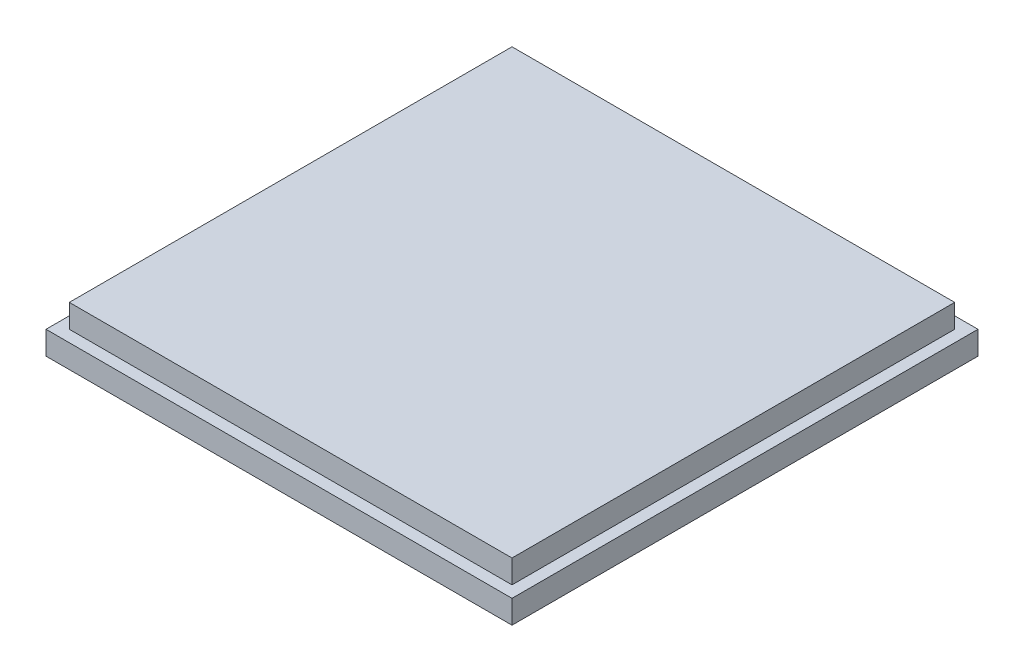
ISO-10303-21;
HEADER;
FILE_DESCRIPTION(('STEP AP214'),'2;1');
FILE_NAME('part.step','',(''),(''),'','','');
FILE_SCHEMA(('AUTOMOTIVE_DESIGN { 1 0 10303 214 1 1 1 1 }'));
ENDSEC;
DATA;
#1=APPLICATION_CONTEXT('core data for automotive mechanical design processes');
#2=APPLICATION_PROTOCOL_DEFINITION('international standard','automotive_design',2000,#1);
#3=PRODUCT_CONTEXT('',#1,'mechanical');
#4=PRODUCT('Part','Part','',(#3));
#5=PRODUCT_RELATED_PRODUCT_CATEGORY('part','',(#4));
#6=PRODUCT_DEFINITION_FORMATION('','',#4);
#7=PRODUCT_DEFINITION_CONTEXT('part definition',#1,'design');
#8=PRODUCT_DEFINITION('design','',#6,#7);
#9=PRODUCT_DEFINITION_SHAPE('','',#8);
#10=(LENGTH_UNIT() NAMED_UNIT(*) SI_UNIT(.MILLI.,.METRE.));
#11=(NAMED_UNIT(*) PLANE_ANGLE_UNIT() SI_UNIT($,.RADIAN.));
#12=(NAMED_UNIT(*) SI_UNIT($,.STERADIAN.) SOLID_ANGLE_UNIT());
#13=UNCERTAINTY_MEASURE_WITH_UNIT(LENGTH_MEASURE(1.E-05),#10,'distance_accuracy_value','');
#14=(GEOMETRIC_REPRESENTATION_CONTEXT(3) GLOBAL_UNCERTAINTY_ASSIGNED_CONTEXT((#13)) GLOBAL_UNIT_ASSIGNED_CONTEXT((#10,
#11,#12)) REPRESENTATION_CONTEXT('',''));
#15=CARTESIAN_POINT('',(0.,0.,0.));
#16=DIRECTION('',(0.,0.,1.));
#17=DIRECTION('',(1.,0.,0.));
#18=AXIS2_PLACEMENT_3D('',#15,#16,#17);
#19=CARTESIAN_POINT('',(0.,2.54,0.));
#20=DIRECTION('',(0.,-1.,0.));
#21=DIRECTION('',(0.,0.,-1.));
#22=AXIS2_PLACEMENT_3D('',#19,#20,#21);
#23=PLANE('',#22);
#24=DIRECTION('',(0.,0.,1.));
#25=VECTOR('',#24,1.);
#26=CARTESIAN_POINT('',(0.,2.54,0.));
#27=LINE('',#26,#25);
#28=CARTESIAN_POINT('',(0.,2.54,-50.8));
#29=VERTEX_POINT('',#28);
#30=CARTESIAN_POINT('',(0.,2.54,0.));
#31=VERTEX_POINT('',#30);
#32=EDGE_CURVE('E139',#29,#31,#27,.T.);
#33=ORIENTED_EDGE('',*,*,#32,.T.);
#34=DIRECTION('',(1.,0.,0.));
#35=VECTOR('',#34,1.);
#36=CARTESIAN_POINT('',(0.,2.54,0.));
#37=LINE('',#36,#35);
#38=CARTESIAN_POINT('',(50.8,2.54,0.));
#39=VERTEX_POINT('',#38);
#40=EDGE_CURVE('E143',#31,#39,#37,.T.);
#41=ORIENTED_EDGE('',*,*,#40,.T.);
#42=DIRECTION('',(0.,0.,-1.));
#43=VECTOR('',#42,1.);
#44=CARTESIAN_POINT('',(50.8,2.54,0.));
#45=LINE('',#44,#43);
#46=CARTESIAN_POINT('',(50.8,2.54,-50.8));
#47=VERTEX_POINT('',#46);
#48=EDGE_CURVE('E147',#39,#47,#45,.T.);
#49=ORIENTED_EDGE('',*,*,#48,.T.);
#50=DIRECTION('',(-1.,0.,0.));
#51=VECTOR('',#50,1.);
#52=CARTESIAN_POINT('',(0.,2.54,-50.8));
#53=LINE('',#52,#51);
#54=EDGE_CURVE('E150',#47,#29,#53,.T.);
#55=ORIENTED_EDGE('',*,*,#54,.T.);
#56=EDGE_LOOP('',(#33,#41,#49,#55));
#57=FACE_BOUND('',#56,.T.);
#58=DIRECTION('',(0.,0.,1.));
#59=VECTOR('',#58,1.);
#60=CARTESIAN_POINT('',(1.26999999999999,2.54,-1.27));
#61=LINE('',#60,#59);
#62=CARTESIAN_POINT('',(1.27,2.54,-49.53));
#63=VERTEX_POINT('',#62);
#64=CARTESIAN_POINT('',(1.26999999999999,2.54,-1.27));
#65=VERTEX_POINT('',#64);
#66=EDGE_CURVE('E55',#63,#65,#61,.T.);
#67=ORIENTED_EDGE('',*,*,#66,.F.);
#68=DIRECTION('',(-1.,0.,0.));
#69=VECTOR('',#68,1.);
#70=CARTESIAN_POINT('',(1.27,2.54,-49.53));
#71=LINE('',#70,#69);
#72=CARTESIAN_POINT('',(49.53,2.54,-49.53));
#73=VERTEX_POINT('',#72);
#74=EDGE_CURVE('E59',#73,#63,#71,.T.);
#75=ORIENTED_EDGE('',*,*,#74,.F.);
#76=DIRECTION('',(0.,0.,-1.));
#77=VECTOR('',#76,1.);
#78=CARTESIAN_POINT('',(49.53,2.54,-1.27));
#79=LINE('',#78,#77);
#80=CARTESIAN_POINT('',(49.53,2.54,-1.27));
#81=VERTEX_POINT('',#80);
#82=EDGE_CURVE('E283',#81,#73,#79,.T.);
#83=ORIENTED_EDGE('',*,*,#82,.F.);
#84=DIRECTION('',(1.,0.,0.));
#85=VECTOR('',#84,1.);
#86=CARTESIAN_POINT('',(1.26999999999999,2.54,-1.27));
#87=LINE('',#86,#85);
#88=EDGE_CURVE('E293',#65,#81,#87,.T.);
#89=ORIENTED_EDGE('',*,*,#88,.F.);
#90=EDGE_LOOP('',(#67,#75,#83,#89));
#91=FACE_BOUND('',#90,.T.);
#92=ADVANCED_FACE('F39',(#57,#91),#23,.F.);
#93=CARTESIAN_POINT('',(0.,2.54,0.));
#94=DIRECTION('',(1.,0.,0.));
#95=DIRECTION('',(0.,0.,-1.));
#96=AXIS2_PLACEMENT_3D('',#93,#94,#95);
#97=PLANE('',#96);
#98=DIRECTION('',(0.,0.,1.));
#99=VECTOR('',#98,1.);
#100=CARTESIAN_POINT('',(0.,0.,0.));
#101=LINE('',#100,#99);
#102=CARTESIAN_POINT('',(0.,0.,-50.8));
#103=VERTEX_POINT('',#102);
#104=CARTESIAN_POINT('',(0.,0.,0.));
#105=VERTEX_POINT('',#104);
#106=EDGE_CURVE('E128',#103,#105,#101,.T.);
#107=ORIENTED_EDGE('',*,*,#106,.T.);
#108=DIRECTION('',(0.,-1.,0.));
#109=VECTOR('',#108,1.);
#110=CARTESIAN_POINT('',(0.,2.54,0.));
#111=LINE('',#110,#109);
#112=EDGE_CURVE('E11',#31,#105,#111,.T.);
#113=ORIENTED_EDGE('',*,*,#112,.F.);
#114=ORIENTED_EDGE('',*,*,#32,.F.);
#115=DIRECTION('',(0.,-1.,0.));
#116=VECTOR('',#115,1.);
#117=CARTESIAN_POINT('',(0.,2.54,-50.8));
#118=LINE('',#117,#116);
#119=EDGE_CURVE('E152',#29,#103,#118,.T.);
#120=ORIENTED_EDGE('',*,*,#119,.T.);
#121=EDGE_LOOP('',(#107,#113,#114,#120));
#122=FACE_BOUND('',#121,.T.);
#123=ADVANCED_FACE('F41',(#122),#97,.F.);
#124=CARTESIAN_POINT('',(0.,2.54,0.));
#125=DIRECTION('',(0.,0.,-1.));
#126=DIRECTION('',(-1.,0.,0.));
#127=AXIS2_PLACEMENT_3D('',#124,#125,#126);
#128=PLANE('',#127);
#129=DIRECTION('',(1.,0.,0.));
#130=VECTOR('',#129,1.);
#131=CARTESIAN_POINT('',(0.,0.,0.));
#132=LINE('',#131,#130);
#133=CARTESIAN_POINT('',(50.8,0.,0.));
#134=VERTEX_POINT('',#133);
#135=EDGE_CURVE('E133',#105,#134,#132,.T.);
#136=ORIENTED_EDGE('',*,*,#135,.T.);
#137=DIRECTION('',(0.,-1.,0.));
#138=VECTOR('',#137,1.);
#139=CARTESIAN_POINT('',(50.8,2.54,0.));
#140=LINE('',#139,#138);
#141=EDGE_CURVE('E48',#39,#134,#140,.T.);
#142=ORIENTED_EDGE('',*,*,#141,.F.);
#143=ORIENTED_EDGE('',*,*,#40,.F.);
#144=ORIENTED_EDGE('',*,*,#112,.T.);
#145=EDGE_LOOP('',(#136,#142,#143,#144));
#146=FACE_BOUND('',#145,.T.);
#147=ADVANCED_FACE('F188',(#146),#128,.F.);
#148=CARTESIAN_POINT('',(50.8,2.54,0.));
#149=DIRECTION('',(-1.,0.,0.));
#150=DIRECTION('',(0.,0.,1.));
#151=AXIS2_PLACEMENT_3D('',#148,#149,#150);
#152=PLANE('',#151);
#153=DIRECTION('',(0.,0.,-1.));
#154=VECTOR('',#153,1.);
#155=CARTESIAN_POINT('',(50.8,0.,0.));
#156=LINE('',#155,#154);
#157=CARTESIAN_POINT('',(50.8,0.,-50.8));
#158=VERTEX_POINT('',#157);
#159=EDGE_CURVE('E156',#134,#158,#156,.T.);
#160=ORIENTED_EDGE('',*,*,#159,.T.);
#161=DIRECTION('',(0.,-1.,0.));
#162=VECTOR('',#161,1.);
#163=CARTESIAN_POINT('',(50.8,2.54,-50.8));
#164=LINE('',#163,#162);
#165=EDGE_CURVE('E164',#47,#158,#164,.T.);
#166=ORIENTED_EDGE('',*,*,#165,.F.);
#167=ORIENTED_EDGE('',*,*,#48,.F.);
#168=ORIENTED_EDGE('',*,*,#141,.T.);
#169=EDGE_LOOP('',(#160,#166,#167,#168));
#170=FACE_BOUND('',#169,.T.);
#171=ADVANCED_FACE('F173',(#170),#152,.F.);
#172=CARTESIAN_POINT('',(0.,2.54,-50.8));
#173=DIRECTION('',(0.,0.,1.));
#174=DIRECTION('',(1.,0.,0.));
#175=AXIS2_PLACEMENT_3D('',#172,#173,#174);
#176=PLANE('',#175);
#177=DIRECTION('',(-1.,0.,0.));
#178=VECTOR('',#177,1.);
#179=CARTESIAN_POINT('',(0.,0.,-50.8));
#180=LINE('',#179,#178);
#181=EDGE_CURVE('E144',#158,#103,#180,.T.);
#182=ORIENTED_EDGE('',*,*,#181,.T.);
#183=ORIENTED_EDGE('',*,*,#119,.F.);
#184=ORIENTED_EDGE('',*,*,#54,.F.);
#185=ORIENTED_EDGE('',*,*,#165,.T.);
#186=EDGE_LOOP('',(#182,#183,#184,#185));
#187=FACE_BOUND('',#186,.T.);
#188=ADVANCED_FACE('F182',(#187),#176,.F.);
#189=CARTESIAN_POINT('',(0.,0.,0.));
#190=DIRECTION('',(0.,-1.,0.));
#191=DIRECTION('',(0.,0.,-1.));
#192=AXIS2_PLACEMENT_3D('',#189,#190,#191);
#193=PLANE('',#192);
#194=ORIENTED_EDGE('',*,*,#106,.F.);
#195=ORIENTED_EDGE('',*,*,#181,.F.);
#196=ORIENTED_EDGE('',*,*,#159,.F.);
#197=ORIENTED_EDGE('',*,*,#135,.F.);
#198=EDGE_LOOP('',(#194,#195,#196,#197));
#199=FACE_BOUND('',#198,.T.);
#200=ADVANCED_FACE('F179',(#199),#193,.T.);
#201=CARTESIAN_POINT('',(1.26999999999999,5.08,-1.27));
#202=DIRECTION('',(1.,0.,0.));
#203=DIRECTION('',(0.,0.,-1.));
#204=AXIS2_PLACEMENT_3D('',#201,#202,#203);
#205=PLANE('',#204);
#206=ORIENTED_EDGE('',*,*,#66,.T.);
#207=DIRECTION('',(0.,-1.,0.));
#208=VECTOR('',#207,1.);
#209=CARTESIAN_POINT('',(1.26999999999999,5.08,-1.27));
#210=LINE('',#209,#208);
#211=CARTESIAN_POINT('',(1.26999999999999,5.08,-1.27));
#212=VERTEX_POINT('',#211);
#213=EDGE_CURVE('E108',#212,#65,#210,.T.);
#214=ORIENTED_EDGE('',*,*,#213,.F.);
#215=DIRECTION('',(0.,0.,1.));
#216=VECTOR('',#215,1.);
#217=CARTESIAN_POINT('',(1.26999999999999,5.08,-1.27));
#218=LINE('',#217,#216);
#219=CARTESIAN_POINT('',(1.27,5.08,-49.53));
#220=VERTEX_POINT('',#219);
#221=EDGE_CURVE('E115',#220,#212,#218,.T.);
#222=ORIENTED_EDGE('',*,*,#221,.F.);
#223=DIRECTION('',(0.,-1.,0.));
#224=VECTOR('',#223,1.);
#225=CARTESIAN_POINT('',(1.27,5.08,-49.53));
#226=LINE('',#225,#224);
#227=EDGE_CURVE('E280',#220,#63,#226,.T.);
#228=ORIENTED_EDGE('',*,*,#227,.T.);
#229=EDGE_LOOP('',(#206,#214,#222,#228));
#230=FACE_BOUND('',#229,.T.);
#231=ADVANCED_FACE('F126',(#230),#205,.F.);
#232=CARTESIAN_POINT('',(1.26999999999999,5.08,-1.27));
#233=DIRECTION('',(0.,0.,-1.));
#234=DIRECTION('',(-1.,0.,0.));
#235=AXIS2_PLACEMENT_3D('',#232,#233,#234);
#236=PLANE('',#235);
#237=ORIENTED_EDGE('',*,*,#88,.T.);
#238=DIRECTION('',(0.,-1.,0.));
#239=VECTOR('',#238,1.);
#240=CARTESIAN_POINT('',(49.53,5.08,-1.27));
#241=LINE('',#240,#239);
#242=CARTESIAN_POINT('',(49.53,5.08,-1.27));
#243=VERTEX_POINT('',#242);
#244=EDGE_CURVE('E110',#243,#81,#241,.T.);
#245=ORIENTED_EDGE('',*,*,#244,.F.);
#246=DIRECTION('',(1.,0.,0.));
#247=VECTOR('',#246,1.);
#248=CARTESIAN_POINT('',(1.26999999999999,5.08,-1.27));
#249=LINE('',#248,#247);
#250=EDGE_CURVE('E103',#212,#243,#249,.T.);
#251=ORIENTED_EDGE('',*,*,#250,.F.);
#252=ORIENTED_EDGE('',*,*,#213,.T.);
#253=EDGE_LOOP('',(#237,#245,#251,#252));
#254=FACE_BOUND('',#253,.T.);
#255=ADVANCED_FACE('F106',(#254),#236,.F.);
#256=CARTESIAN_POINT('',(49.53,5.08,-1.27));
#257=DIRECTION('',(-1.,0.,0.));
#258=DIRECTION('',(0.,0.,1.));
#259=AXIS2_PLACEMENT_3D('',#256,#257,#258);
#260=PLANE('',#259);
#261=ORIENTED_EDGE('',*,*,#82,.T.);
#262=DIRECTION('',(0.,-1.,0.));
#263=VECTOR('',#262,1.);
#264=CARTESIAN_POINT('',(49.53,5.08,-49.53));
#265=LINE('',#264,#263);
#266=CARTESIAN_POINT('',(49.53,5.08,-49.53));
#267=VERTEX_POINT('',#266);
#268=EDGE_CURVE('E135',#267,#73,#265,.T.);
#269=ORIENTED_EDGE('',*,*,#268,.F.);
#270=DIRECTION('',(0.,0.,-1.));
#271=VECTOR('',#270,1.);
#272=CARTESIAN_POINT('',(49.53,5.08,-1.27));
#273=LINE('',#272,#271);
#274=EDGE_CURVE('E114',#243,#267,#273,.T.);
#275=ORIENTED_EDGE('',*,*,#274,.F.);
#276=ORIENTED_EDGE('',*,*,#244,.T.);
#277=EDGE_LOOP('',(#261,#269,#275,#276));
#278=FACE_BOUND('',#277,.T.);
#279=ADVANCED_FACE('F224',(#278),#260,.F.);
#280=CARTESIAN_POINT('',(1.27,5.08,-49.53));
#281=DIRECTION('',(0.,0.,1.));
#282=DIRECTION('',(1.,0.,0.));
#283=AXIS2_PLACEMENT_3D('',#280,#281,#282);
#284=PLANE('',#283);
#285=ORIENTED_EDGE('',*,*,#74,.T.);
#286=ORIENTED_EDGE('',*,*,#227,.F.);
#287=DIRECTION('',(-1.,0.,0.));
#288=VECTOR('',#287,1.);
#289=CARTESIAN_POINT('',(1.27,5.08,-49.53));
#290=LINE('',#289,#288);
#291=EDGE_CURVE('E120',#267,#220,#290,.T.);
#292=ORIENTED_EDGE('',*,*,#291,.F.);
#293=ORIENTED_EDGE('',*,*,#268,.T.);
#294=EDGE_LOOP('',(#285,#286,#292,#293));
#295=FACE_BOUND('',#294,.T.);
#296=ADVANCED_FACE('F230',(#295),#284,.F.);
#297=CARTESIAN_POINT('',(0.,5.08,0.));
#298=DIRECTION('',(0.,-1.,0.));
#299=DIRECTION('',(0.,0.,-1.));
#300=AXIS2_PLACEMENT_3D('',#297,#298,#299);
#301=PLANE('',#300);
#302=ORIENTED_EDGE('',*,*,#221,.T.);
#303=ORIENTED_EDGE('',*,*,#250,.T.);
#304=ORIENTED_EDGE('',*,*,#274,.T.);
#305=ORIENTED_EDGE('',*,*,#291,.T.);
#306=EDGE_LOOP('',(#302,#303,#304,#305));
#307=FACE_BOUND('',#306,.T.);
#308=ADVANCED_FACE('F118',(#307),#301,.F.);
#309=CLOSED_SHELL('',(#92,#123,#147,#171,#188,#200,#231,#255,#279,#296,#308));
#310=MANIFOLD_SOLID_BREP('B2',#309);
#311=ADVANCED_BREP_SHAPE_REPRESENTATION('',(#18,#310),#14);
#312=SHAPE_DEFINITION_REPRESENTATION(#9,#311);
ENDSEC;
END-ISO-10303-21;
